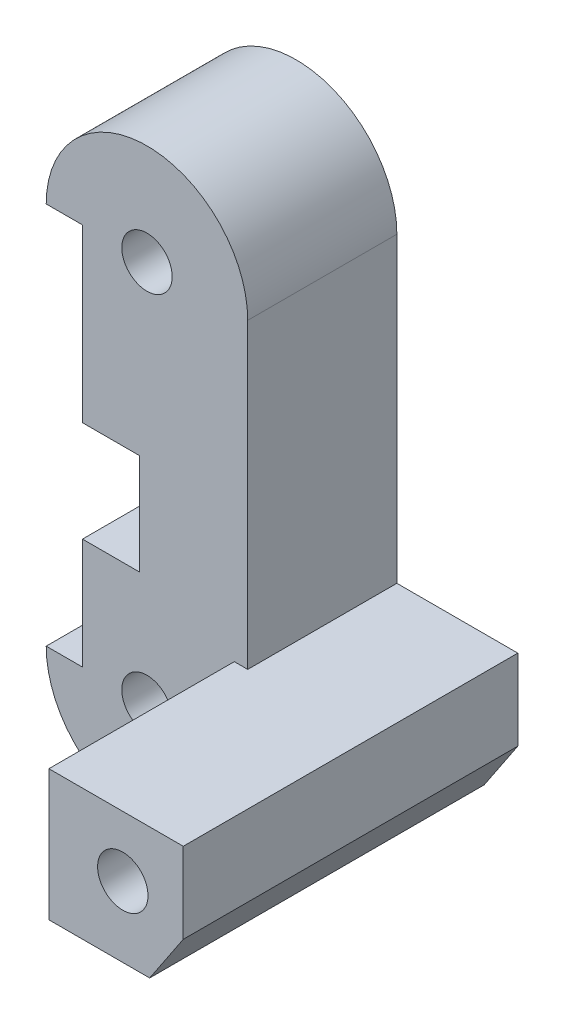
ISO-10303-21;
HEADER;
FILE_DESCRIPTION(('STEP AP214'),'2;1');
FILE_NAME('part.step','',(''),(''),'','','');
FILE_SCHEMA(('AUTOMOTIVE_DESIGN { 1 0 10303 214 1 1 1 1 }'));
ENDSEC;
DATA;
#1=APPLICATION_CONTEXT('core data for automotive mechanical design processes');
#2=APPLICATION_PROTOCOL_DEFINITION('international standard','automotive_design',2000,#1);
#3=PRODUCT_CONTEXT('',#1,'mechanical');
#4=PRODUCT('Part','Part','',(#3));
#5=PRODUCT_RELATED_PRODUCT_CATEGORY('part','',(#4));
#6=PRODUCT_DEFINITION_FORMATION('','',#4);
#7=PRODUCT_DEFINITION_CONTEXT('part definition',#1,'design');
#8=PRODUCT_DEFINITION('design','',#6,#7);
#9=PRODUCT_DEFINITION_SHAPE('','',#8);
#10=(LENGTH_UNIT() NAMED_UNIT(*) SI_UNIT(.MILLI.,.METRE.));
#11=(NAMED_UNIT(*) PLANE_ANGLE_UNIT() SI_UNIT($,.RADIAN.));
#12=(NAMED_UNIT(*) SI_UNIT($,.STERADIAN.) SOLID_ANGLE_UNIT());
#13=UNCERTAINTY_MEASURE_WITH_UNIT(LENGTH_MEASURE(1.E-05),#10,'distance_accuracy_value','');
#14=(GEOMETRIC_REPRESENTATION_CONTEXT(3) GLOBAL_UNCERTAINTY_ASSIGNED_CONTEXT((#13)) GLOBAL_UNIT_ASSIGNED_CONTEXT((#10,
#11,#12)) REPRESENTATION_CONTEXT('',''));
#15=CARTESIAN_POINT('',(0.,0.,0.));
#16=DIRECTION('',(0.,0.,1.));
#17=DIRECTION('',(1.,0.,0.));
#18=AXIS2_PLACEMENT_3D('',#15,#16,#17);
#19=CARTESIAN_POINT('',(-3.2,19.,7.4));
#20=DIRECTION('',(0.,1.,0.));
#21=DIRECTION('',(0.,0.,1.));
#22=AXIS2_PLACEMENT_3D('',#19,#20,#21);
#23=PLANE('',#22);
#24=DIRECTION('',(1.,0.,0.));
#25=VECTOR('',#24,1.);
#26=CARTESIAN_POINT('',(-3.2,19.,0.));
#27=LINE('',#26,#25);
#28=CARTESIAN_POINT('',(-5.,19.,0.));
#29=VERTEX_POINT('',#28);
#30=CARTESIAN_POINT('',(-3.2,19.,0.));
#31=VERTEX_POINT('',#30);
#32=EDGE_CURVE('E195',#29,#31,#27,.T.);
#33=ORIENTED_EDGE('',*,*,#32,.T.);
#34=DIRECTION('',(0.,0.,-1.));
#35=VECTOR('',#34,1.);
#36=CARTESIAN_POINT('',(-3.2,19.,7.4));
#37=LINE('',#36,#35);
#38=CARTESIAN_POINT('',(-3.2,19.,7.4));
#39=VERTEX_POINT('',#38);
#40=EDGE_CURVE('E239',#39,#31,#37,.T.);
#41=ORIENTED_EDGE('',*,*,#40,.F.);
#42=DIRECTION('',(1.,0.,0.));
#43=VECTOR('',#42,1.);
#44=CARTESIAN_POINT('',(-3.2,19.,7.4));
#45=LINE('',#44,#43);
#46=CARTESIAN_POINT('',(-5.,19.,7.4));
#47=VERTEX_POINT('',#46);
#48=EDGE_CURVE('E179',#47,#39,#45,.T.);
#49=ORIENTED_EDGE('',*,*,#48,.F.);
#50=DIRECTION('',(0.,0.,-1.));
#51=VECTOR('',#50,1.);
#52=CARTESIAN_POINT('',(-5.,19.,7.4));
#53=LINE('',#52,#51);
#54=EDGE_CURVE('E194',#47,#29,#53,.T.);
#55=ORIENTED_EDGE('',*,*,#54,.T.);
#56=EDGE_LOOP('',(#33,#41,#49,#55));
#57=FACE_BOUND('',#56,.T.);
#58=ADVANCED_FACE('F39',(#57),#23,.F.);
#59=CARTESIAN_POINT('',(-3.2,19.,7.4));
#60=DIRECTION('',(1.,0.,0.));
#61=DIRECTION('',(0.,1.,0.));
#62=AXIS2_PLACEMENT_3D('',#59,#60,#61);
#63=PLANE('',#62);
#64=CARTESIAN_POINT('',(-3.2,14.,4.4));
#65=DIRECTION('',(-1.,0.,0.));
#66=DIRECTION('',(0.,0.,1.));
#67=AXIS2_PLACEMENT_3D('',#64,#65,#66);
#68=CIRCLE('',#67,1.24999999999999);
#69=CARTESIAN_POINT('',(-3.2,14.,5.64999999999999));
#70=VERTEX_POINT('',#69);
#71=EDGE_CURVE('E315',#70,#70,#68,.T.);
#72=ORIENTED_EDGE('',*,*,#71,.F.);
#73=EDGE_LOOP('',(#72));
#74=FACE_BOUND('',#73,.T.);
#75=CARTESIAN_POINT('',(-3.2,4.,4.4));
#76=DIRECTION('',(-1.,0.,0.));
#77=DIRECTION('',(0.,0.,1.));
#78=AXIS2_PLACEMENT_3D('',#75,#76,#77);
#79=CIRCLE('',#78,1.24999999999999);
#80=CARTESIAN_POINT('',(-3.2,4.,5.64999999999999));
#81=VERTEX_POINT('',#80);
#82=EDGE_CURVE('E301',#81,#81,#79,.T.);
#83=ORIENTED_EDGE('',*,*,#82,.F.);
#84=EDGE_LOOP('',(#83));
#85=FACE_BOUND('',#84,.T.);
#86=DIRECTION('',(0.,-1.,0.));
#87=VECTOR('',#86,1.);
#88=CARTESIAN_POINT('',(-3.2,10.5,4.57157287525381));
#89=LINE('',#88,#87);
#90=CARTESIAN_POINT('',(-3.2,10.5,4.57157287525381));
#91=VERTEX_POINT('',#90);
#92=CARTESIAN_POINT('',(-3.2,5.5,4.57157287525381));
#93=VERTEX_POINT('',#92);
#94=EDGE_CURVE('E173',#91,#93,#89,.T.);
#95=ORIENTED_EDGE('',*,*,#94,.F.);
#96=DIRECTION('',(0.,0.,1.));
#97=VECTOR('',#96,1.);
#98=CARTESIAN_POINT('',(-3.2,10.5,4.57157287525381));
#99=LINE('',#98,#97);
#100=CARTESIAN_POINT('',(-3.2,10.5,7.4));
#101=VERTEX_POINT('',#100);
#102=EDGE_CURVE('E161',#91,#101,#99,.T.);
#103=ORIENTED_EDGE('',*,*,#102,.T.);
#104=DIRECTION('',(0.,-1.,0.));
#105=VECTOR('',#104,1.);
#106=CARTESIAN_POINT('',(-3.2,19.,7.4));
#107=LINE('',#106,#105);
#108=EDGE_CURVE('E170',#39,#101,#107,.T.);
#109=ORIENTED_EDGE('',*,*,#108,.F.);
#110=ORIENTED_EDGE('',*,*,#40,.T.);
#111=DIRECTION('',(0.,-1.,0.));
#112=VECTOR('',#111,1.);
#113=CARTESIAN_POINT('',(-3.2,19.,0.));
#114=LINE('',#113,#112);
#115=CARTESIAN_POINT('',(-3.2,0.,0.));
#116=VERTEX_POINT('',#115);
#117=EDGE_CURVE('E198',#31,#116,#114,.T.);
#118=ORIENTED_EDGE('',*,*,#117,.T.);
#119=DIRECTION('',(0.,0.,-1.));
#120=VECTOR('',#119,1.);
#121=CARTESIAN_POINT('',(-3.2,0.,7.4));
#122=LINE('',#121,#120);
#123=CARTESIAN_POINT('',(-3.2,0.,7.4));
#124=VERTEX_POINT('',#123);
#125=EDGE_CURVE('E236',#124,#116,#122,.T.);
#126=ORIENTED_EDGE('',*,*,#125,.F.);
#127=CARTESIAN_POINT('',(-3.2,5.5,7.4));
#128=VERTEX_POINT('',#127);
#129=EDGE_CURVE('E182',#128,#124,#107,.T.);
#130=ORIENTED_EDGE('',*,*,#129,.F.);
#131=DIRECTION('',(0.,0.,1.));
#132=VECTOR('',#131,1.);
#133=CARTESIAN_POINT('',(-3.2,5.5,4.57157287525381));
#134=LINE('',#133,#132);
#135=EDGE_CURVE('E54',#93,#128,#134,.T.);
#136=ORIENTED_EDGE('',*,*,#135,.F.);
#137=EDGE_LOOP('',(#95,#103,#109,#110,#118,#126,#130,#136));
#138=FACE_BOUND('',#137,.T.);
#139=ADVANCED_FACE('F168',(#74,#85,#138),#63,.F.);
#140=CARTESIAN_POINT('',(-3.2,0.,7.4));
#141=DIRECTION('',(0.,-1.,0.));
#142=DIRECTION('',(1.,0.,0.));
#143=AXIS2_PLACEMENT_3D('',#140,#141,#142);
#144=PLANE('',#143);
#145=DIRECTION('',(-1.,0.,0.));
#146=VECTOR('',#145,1.);
#147=CARTESIAN_POINT('',(-3.2,0.,0.));
#148=LINE('',#147,#146);
#149=CARTESIAN_POINT('',(-5.,0.,0.));
#150=VERTEX_POINT('',#149);
#151=EDGE_CURVE('E201',#116,#150,#148,.T.);
#152=ORIENTED_EDGE('',*,*,#151,.T.);
#153=DIRECTION('',(0.,0.,-1.));
#154=VECTOR('',#153,1.);
#155=CARTESIAN_POINT('',(-5.,0.,7.4));
#156=LINE('',#155,#154);
#157=CARTESIAN_POINT('',(-5.,0.,7.4));
#158=VERTEX_POINT('',#157);
#159=EDGE_CURVE('E233',#158,#150,#156,.T.);
#160=ORIENTED_EDGE('',*,*,#159,.F.);
#161=DIRECTION('',(-1.,0.,0.));
#162=VECTOR('',#161,1.);
#163=CARTESIAN_POINT('',(-3.2,0.,7.4));
#164=LINE('',#163,#162);
#165=EDGE_CURVE('E181',#124,#158,#164,.T.);
#166=ORIENTED_EDGE('',*,*,#165,.F.);
#167=ORIENTED_EDGE('',*,*,#125,.T.);
#168=EDGE_LOOP('',(#152,#160,#166,#167));
#169=FACE_BOUND('',#168,.T.);
#170=ADVANCED_FACE('F345',(#169),#144,.F.);
#171=CARTESIAN_POINT('',(0.,0.,7.4));
#172=DIRECTION('',(0.,0.,-1.));
#173=DIRECTION('',(-1.,0.,0.));
#174=AXIS2_PLACEMENT_3D('',#171,#172,#173);
#175=CYLINDRICAL_SURFACE('',#174,5.);
#176=CARTESIAN_POINT('',(0.,0.,0.));
#177=DIRECTION('',(0.,0.,1.));
#178=DIRECTION('',(1.,0.,0.));
#179=AXIS2_PLACEMENT_3D('',#176,#177,#178);
#180=CIRCLE('',#179,5.);
#181=CARTESIAN_POINT('',(3.83326103686206,-3.21031304132092,0.));
#182=VERTEX_POINT('',#181);
#183=EDGE_CURVE('E203',#150,#182,#180,.T.);
#184=ORIENTED_EDGE('',*,*,#183,.T.);
#185=DIRECTION('',(0.,0.,-1.));
#186=VECTOR('',#185,1.);
#187=CARTESIAN_POINT('',(3.83326103686206,-3.21031304132092,7.4));
#188=LINE('',#187,#186);
#189=CARTESIAN_POINT('',(3.83326103686206,-3.21031304132092,7.4));
#190=VERTEX_POINT('',#189);
#191=EDGE_CURVE('E262',#182,#190,#188,.F.);
#192=ORIENTED_EDGE('',*,*,#191,.T.);
#193=CARTESIAN_POINT('',(0.,0.,7.4));
#194=DIRECTION('',(0.,0.,1.));
#195=DIRECTION('',(1.,0.,0.));
#196=AXIS2_PLACEMENT_3D('',#193,#194,#195);
#197=CIRCLE('',#196,5.);
#198=EDGE_CURVE('E184',#158,#190,#197,.T.);
#199=ORIENTED_EDGE('',*,*,#198,.F.);
#200=ORIENTED_EDGE('',*,*,#159,.T.);
#201=EDGE_LOOP('',(#184,#192,#199,#200));
#202=FACE_BOUND('',#201,.T.);
#203=ADVANCED_FACE('F274',(#202),#175,.T.);
#204=CARTESIAN_POINT('',(4.33333333333333,-2.49443825784929,7.4));
#205=DIRECTION('',(0.,1.,0.));
#206=DIRECTION('',(0.,0.,1.));
#207=AXIS2_PLACEMENT_3D('',#204,#205,#206);
#208=PLANE('',#207);
#209=DIRECTION('',(1.,0.,0.));
#210=VECTOR('',#209,1.);
#211=CARTESIAN_POINT('',(4.33333333333333,-2.49443825784929,7.4));
#212=LINE('',#211,#210);
#213=CARTESIAN_POINT('',(4.33333333333333,-2.4944382578493,7.4));
#214=VERTEX_POINT('',#213);
#215=CARTESIAN_POINT('',(5.36656545160689,-2.49443825784929,7.4));
#216=VERTEX_POINT('',#215);
#217=EDGE_CURVE('E61',#214,#216,#212,.T.);
#218=ORIENTED_EDGE('',*,*,#217,.T.);
#219=DIRECTION('',(0.,0.,1.));
#220=VECTOR('',#219,1.);
#221=CARTESIAN_POINT('',(5.36656545160689,-2.49443825784929,0.));
#222=LINE('',#221,#220);
#223=CARTESIAN_POINT('',(5.36656545160689,-2.49443825784929,0.));
#224=VERTEX_POINT('',#223);
#225=EDGE_CURVE('E259',#216,#224,#222,.F.);
#226=ORIENTED_EDGE('',*,*,#225,.T.);
#227=DIRECTION('',(1.,0.,0.));
#228=VECTOR('',#227,1.);
#229=CARTESIAN_POINT('',(4.33333333333333,-2.49443825784929,0.));
#230=LINE('',#229,#228);
#231=CARTESIAN_POINT('',(9.33333333333333,-2.49443825784929,0.));
#232=VERTEX_POINT('',#231);
#233=EDGE_CURVE('E206',#224,#232,#230,.T.);
#234=ORIENTED_EDGE('',*,*,#233,.T.);
#235=DIRECTION('',(0.,0.,-1.));
#236=VECTOR('',#235,1.);
#237=CARTESIAN_POINT('',(9.33333333333333,-2.49443825784929,7.4));
#238=LINE('',#237,#236);
#239=CARTESIAN_POINT('',(9.33333333333333,-2.49443825784929,16.6));
#240=VERTEX_POINT('',#239);
#241=EDGE_CURVE('E230',#240,#232,#238,.T.);
#242=ORIENTED_EDGE('',*,*,#241,.F.);
#243=DIRECTION('',(1.,0.,0.));
#244=VECTOR('',#243,1.);
#245=CARTESIAN_POINT('',(4.33333333333333,-2.4944382578493,16.6));
#246=LINE('',#245,#244);
#247=CARTESIAN_POINT('',(4.33333333333333,-2.4944382578493,16.6));
#248=VERTEX_POINT('',#247);
#249=EDGE_CURVE('E285',#248,#240,#246,.T.);
#250=ORIENTED_EDGE('',*,*,#249,.F.);
#251=DIRECTION('',(0.,0.,-1.));
#252=VECTOR('',#251,1.);
#253=CARTESIAN_POINT('',(4.33333333333333,-2.4944382578493,16.6));
#254=LINE('',#253,#252);
#255=EDGE_CURVE('E282',#248,#214,#254,.T.);
#256=ORIENTED_EDGE('',*,*,#255,.T.);
#257=EDGE_LOOP('',(#218,#226,#234,#242,#250,#256));
#258=FACE_BOUND('',#257,.T.);
#259=ADVANCED_FACE('F279',(#258),#208,.F.);
#260=CARTESIAN_POINT('',(9.33333333333333,-2.49443825784929,7.4));
#261=DIRECTION('',(-0.831479419283099,0.555555555555555,0.));
#262=DIRECTION('',(-0.555555555555555,-0.831479419283099,0.));
#263=AXIS2_PLACEMENT_3D('',#260,#261,#262);
#264=PLANE('',#263);
#265=DIRECTION('',(0.555555555555555,0.831479419283099,0.));
#266=VECTOR('',#265,1.);
#267=CARTESIAN_POINT('',(9.33333333333333,-2.49443825784929,0.));
#268=LINE('',#267,#266);
#269=CARTESIAN_POINT('',(11.,0.,0.));
#270=VERTEX_POINT('',#269);
#271=EDGE_CURVE('E208',#232,#270,#268,.T.);
#272=ORIENTED_EDGE('',*,*,#271,.T.);
#273=DIRECTION('',(0.,0.,-1.));
#274=VECTOR('',#273,1.);
#275=CARTESIAN_POINT('',(11.,0.,7.4));
#276=LINE('',#275,#274);
#277=CARTESIAN_POINT('',(11.,0.,16.6));
#278=VERTEX_POINT('',#277);
#279=EDGE_CURVE('E227',#278,#270,#276,.T.);
#280=ORIENTED_EDGE('',*,*,#279,.F.);
#281=DIRECTION('',(0.555555555555555,0.831479419283099,0.));
#282=VECTOR('',#281,1.);
#283=CARTESIAN_POINT('',(9.33333333333333,-2.49443825784929,16.6));
#284=LINE('',#283,#282);
#285=EDGE_CURVE('E288',#240,#278,#284,.T.);
#286=ORIENTED_EDGE('',*,*,#285,.F.);
#287=ORIENTED_EDGE('',*,*,#241,.T.);
#288=EDGE_LOOP('',(#272,#280,#286,#287));
#289=FACE_BOUND('',#288,.T.);
#290=ADVANCED_FACE('F367',(#289),#264,.F.);
#291=CARTESIAN_POINT('',(11.,0.,7.4));
#292=DIRECTION('',(-1.,0.,0.));
#293=DIRECTION('',(0.,-1.,0.));
#294=AXIS2_PLACEMENT_3D('',#291,#292,#293);
#295=PLANE('',#294);
#296=DIRECTION('',(0.,1.,0.));
#297=VECTOR('',#296,1.);
#298=CARTESIAN_POINT('',(11.,0.,0.));
#299=LINE('',#298,#297);
#300=CARTESIAN_POINT('',(11.,4.,0.));
#301=VERTEX_POINT('',#300);
#302=EDGE_CURVE('E210',#270,#301,#299,.T.);
#303=ORIENTED_EDGE('',*,*,#302,.T.);
#304=DIRECTION('',(0.,0.,-1.));
#305=VECTOR('',#304,1.);
#306=CARTESIAN_POINT('',(11.,4.,7.4));
#307=LINE('',#306,#305);
#308=CARTESIAN_POINT('',(11.,4.,16.6));
#309=VERTEX_POINT('',#308);
#310=EDGE_CURVE('E224',#309,#301,#307,.T.);
#311=ORIENTED_EDGE('',*,*,#310,.F.);
#312=DIRECTION('',(0.,1.,0.));
#313=VECTOR('',#312,1.);
#314=CARTESIAN_POINT('',(11.,0.,16.6));
#315=LINE('',#314,#313);
#316=EDGE_CURVE('E294',#278,#309,#315,.T.);
#317=ORIENTED_EDGE('',*,*,#316,.F.);
#318=ORIENTED_EDGE('',*,*,#279,.T.);
#319=EDGE_LOOP('',(#303,#311,#317,#318));
#320=FACE_BOUND('',#319,.T.);
#321=ADVANCED_FACE('F365',(#320),#295,.F.);
#322=CARTESIAN_POINT('',(11.,4.,7.4));
#323=DIRECTION('',(0.,-1.,0.));
#324=DIRECTION('',(1.,0.,0.));
#325=AXIS2_PLACEMENT_3D('',#322,#323,#324);
#326=PLANE('',#325);
#327=DIRECTION('',(-1.,0.,0.));
#328=VECTOR('',#327,1.);
#329=CARTESIAN_POINT('',(11.,4.,0.));
#330=LINE('',#329,#328);
#331=CARTESIAN_POINT('',(5.,4.,0.));
#332=VERTEX_POINT('',#331);
#333=EDGE_CURVE('E212',#301,#332,#330,.T.);
#334=ORIENTED_EDGE('',*,*,#333,.T.);
#335=DIRECTION('',(0.,0.,-1.));
#336=VECTOR('',#335,1.);
#337=CARTESIAN_POINT('',(5.,4.,7.4));
#338=LINE('',#337,#336);
#339=CARTESIAN_POINT('',(5.,4.,7.4));
#340=VERTEX_POINT('',#339);
#341=EDGE_CURVE('E223',#340,#332,#338,.T.);
#342=ORIENTED_EDGE('',*,*,#341,.F.);
#343=DIRECTION('',(-1.,0.,0.));
#344=VECTOR('',#343,1.);
#345=CARTESIAN_POINT('',(5.,4.,7.4));
#346=LINE('',#345,#344);
#347=CARTESIAN_POINT('',(4.33333333333333,4.,7.4));
#348=VERTEX_POINT('',#347);
#349=EDGE_CURVE('E241',#340,#348,#346,.T.);
#350=ORIENTED_EDGE('',*,*,#349,.T.);
#351=DIRECTION('',(0.,0.,-1.));
#352=VECTOR('',#351,1.);
#353=CARTESIAN_POINT('',(4.33333333333333,4.,16.6));
#354=LINE('',#353,#352);
#355=CARTESIAN_POINT('',(4.33333333333333,4.,16.6));
#356=VERTEX_POINT('',#355);
#357=EDGE_CURVE('E199',#356,#348,#354,.T.);
#358=ORIENTED_EDGE('',*,*,#357,.F.);
#359=DIRECTION('',(-1.,0.,0.));
#360=VECTOR('',#359,1.);
#361=CARTESIAN_POINT('',(11.,4.,16.6));
#362=LINE('',#361,#360);
#363=EDGE_CURVE('E298',#309,#356,#362,.T.);
#364=ORIENTED_EDGE('',*,*,#363,.F.);
#365=ORIENTED_EDGE('',*,*,#310,.T.);
#366=EDGE_LOOP('',(#334,#342,#350,#358,#364,#365));
#367=FACE_BOUND('',#366,.T.);
#368=ADVANCED_FACE('F361',(#367),#326,.F.);
#369=CARTESIAN_POINT('',(5.,4.,7.4));
#370=DIRECTION('',(-1.,0.,0.));
#371=DIRECTION('',(0.,-1.,0.));
#372=AXIS2_PLACEMENT_3D('',#369,#370,#371);
#373=PLANE('',#372);
#374=DIRECTION('',(0.,1.,0.));
#375=VECTOR('',#374,1.);
#376=CARTESIAN_POINT('',(5.,4.,0.));
#377=LINE('',#376,#375);
#378=CARTESIAN_POINT('',(5.,19.,0.));
#379=VERTEX_POINT('',#378);
#380=EDGE_CURVE('E214',#332,#379,#377,.T.);
#381=ORIENTED_EDGE('',*,*,#380,.T.);
#382=DIRECTION('',(0.,0.,-1.));
#383=VECTOR('',#382,1.);
#384=CARTESIAN_POINT('',(5.,19.,7.4));
#385=LINE('',#384,#383);
#386=CARTESIAN_POINT('',(5.,19.,7.4));
#387=VERTEX_POINT('',#386);
#388=EDGE_CURVE('E220',#387,#379,#385,.T.);
#389=ORIENTED_EDGE('',*,*,#388,.F.);
#390=DIRECTION('',(0.,1.,0.));
#391=VECTOR('',#390,1.);
#392=CARTESIAN_POINT('',(5.,4.,7.4));
#393=LINE('',#392,#391);
#394=EDGE_CURVE('E191',#340,#387,#393,.T.);
#395=ORIENTED_EDGE('',*,*,#394,.F.);
#396=ORIENTED_EDGE('',*,*,#341,.T.);
#397=EDGE_LOOP('',(#381,#389,#395,#396));
#398=FACE_BOUND('',#397,.T.);
#399=ADVANCED_FACE('F357',(#398),#373,.F.);
#400=CARTESIAN_POINT('',(0.,19.,7.4));
#401=DIRECTION('',(0.,0.,-1.));
#402=DIRECTION('',(-1.,0.,0.));
#403=AXIS2_PLACEMENT_3D('',#400,#401,#402);
#404=CYLINDRICAL_SURFACE('',#403,5.);
#405=CARTESIAN_POINT('',(0.,19.,0.));
#406=DIRECTION('',(0.,0.,1.));
#407=DIRECTION('',(1.,0.,0.));
#408=AXIS2_PLACEMENT_3D('',#405,#406,#407);
#409=CIRCLE('',#408,5.);
#410=EDGE_CURVE('E216',#379,#29,#409,.T.);
#411=ORIENTED_EDGE('',*,*,#410,.T.);
#412=ORIENTED_EDGE('',*,*,#54,.F.);
#413=CARTESIAN_POINT('',(0.,19.,7.4));
#414=DIRECTION('',(0.,0.,1.));
#415=DIRECTION('',(1.,0.,0.));
#416=AXIS2_PLACEMENT_3D('',#413,#414,#415);
#417=CIRCLE('',#416,5.);
#418=EDGE_CURVE('E192',#387,#47,#417,.T.);
#419=ORIENTED_EDGE('',*,*,#418,.F.);
#420=ORIENTED_EDGE('',*,*,#388,.T.);
#421=EDGE_LOOP('',(#411,#412,#419,#420));
#422=FACE_BOUND('',#421,.T.);
#423=ADVANCED_FACE('F351',(#422),#404,.T.);
#424=CARTESIAN_POINT('',(0.,19.,7.4));
#425=DIRECTION('',(0.,0.,1.));
#426=DIRECTION('',(1.,0.,0.));
#427=AXIS2_PLACEMENT_3D('',#424,#425,#426);
#428=PLANE('',#427);
#429=DIRECTION('',(1.,0.,0.));
#430=VECTOR('',#429,1.);
#431=CARTESIAN_POINT('',(-3.2,10.5,7.4));
#432=LINE('',#431,#430);
#433=CARTESIAN_POINT('',(-0.37157287525381,10.5,7.4));
#434=VERTEX_POINT('',#433);
#435=EDGE_CURVE('E158',#101,#434,#432,.T.);
#436=ORIENTED_EDGE('',*,*,#435,.T.);
#437=DIRECTION('',(0.,-1.,0.));
#438=VECTOR('',#437,1.);
#439=CARTESIAN_POINT('',(-0.37157287525381,10.5,7.4));
#440=LINE('',#439,#438);
#441=CARTESIAN_POINT('',(-0.37157287525381,5.5,7.4));
#442=VERTEX_POINT('',#441);
#443=EDGE_CURVE('E331',#434,#442,#440,.T.);
#444=ORIENTED_EDGE('',*,*,#443,.T.);
#445=DIRECTION('',(1.,0.,0.));
#446=VECTOR('',#445,1.);
#447=CARTESIAN_POINT('',(-3.2,5.5,7.4));
#448=LINE('',#447,#446);
#449=EDGE_CURVE('E335',#128,#442,#448,.T.);
#450=ORIENTED_EDGE('',*,*,#449,.F.);
#451=ORIENTED_EDGE('',*,*,#129,.T.);
#452=ORIENTED_EDGE('',*,*,#165,.T.);
#453=ORIENTED_EDGE('',*,*,#198,.T.);
#454=CARTESIAN_POINT('',(5.36656545160689,-4.49443825784929,7.4));
#455=DIRECTION('',(0.,0.,1.));
#456=DIRECTION('',(1.,0.,0.));
#457=AXIS2_PLACEMENT_3D('',#454,#455,#456);
#458=CIRCLE('',#457,2.);
#459=EDGE_CURVE('E11',#190,#216,#458,.F.);
#460=ORIENTED_EDGE('',*,*,#459,.T.);
#461=ORIENTED_EDGE('',*,*,#217,.F.);
#462=DIRECTION('',(0.,-1.,0.));
#463=VECTOR('',#462,1.);
#464=CARTESIAN_POINT('',(4.33333333333333,-2.4944382578493,7.4));
#465=LINE('',#464,#463);
#466=EDGE_CURVE('E291',#348,#214,#465,.T.);
#467=ORIENTED_EDGE('',*,*,#466,.F.);
#468=ORIENTED_EDGE('',*,*,#349,.F.);
#469=ORIENTED_EDGE('',*,*,#394,.T.);
#470=ORIENTED_EDGE('',*,*,#418,.T.);
#471=ORIENTED_EDGE('',*,*,#48,.T.);
#472=ORIENTED_EDGE('',*,*,#108,.T.);
#473=EDGE_LOOP('',(#436,#444,#450,#451,#452,#453,#460,#461,#467,#468,#469,#470,#471,#472));
#474=FACE_BOUND('',#473,.T.);
#475=CARTESIAN_POINT('',(0.,0.,7.4));
#476=DIRECTION('',(0.,0.,1.));
#477=DIRECTION('',(1.,0.,0.));
#478=AXIS2_PLACEMENT_3D('',#475,#476,#477);
#479=CIRCLE('',#478,1.24999999999999);
#480=CARTESIAN_POINT('',(1.24999999999999,0.,7.4));
#481=VERTEX_POINT('',#480);
#482=EDGE_CURVE('E256',#481,#481,#479,.T.);
#483=ORIENTED_EDGE('',*,*,#482,.F.);
#484=EDGE_LOOP('',(#483));
#485=FACE_BOUND('',#484,.T.);
#486=CARTESIAN_POINT('',(0.,19.,7.4));
#487=DIRECTION('',(0.,0.,1.));
#488=DIRECTION('',(1.,0.,0.));
#489=AXIS2_PLACEMENT_3D('',#486,#487,#488);
#490=CIRCLE('',#489,1.24999999999999);
#491=CARTESIAN_POINT('',(1.24999999999999,19.,7.4));
#492=VERTEX_POINT('',#491);
#493=EDGE_CURVE('E321',#492,#492,#490,.T.);
#494=ORIENTED_EDGE('',*,*,#493,.F.);
#495=EDGE_LOOP('',(#494));
#496=FACE_BOUND('',#495,.T.);
#497=ADVANCED_FACE('F176',(#474,#485,#496),#428,.T.);
#498=CARTESIAN_POINT('',(0.,19.,0.));
#499=DIRECTION('',(0.,0.,1.));
#500=DIRECTION('',(1.,0.,0.));
#501=AXIS2_PLACEMENT_3D('',#498,#499,#500);
#502=PLANE('',#501);
#503=CARTESIAN_POINT('',(8.,1.,0.));
#504=DIRECTION('',(0.,0.,1.));
#505=DIRECTION('',(1.,0.,0.));
#506=AXIS2_PLACEMENT_3D('',#503,#504,#505);
#507=CIRCLE('',#506,1.24999999999999);
#508=CARTESIAN_POINT('',(9.24999999999999,1.,0.));
#509=VERTEX_POINT('',#508);
#510=EDGE_CURVE('E253',#509,#509,#507,.T.);
#511=ORIENTED_EDGE('',*,*,#510,.T.);
#512=EDGE_LOOP('',(#511));
#513=FACE_BOUND('',#512,.T.);
#514=CARTESIAN_POINT('',(0.,0.,0.));
#515=DIRECTION('',(0.,0.,1.));
#516=DIRECTION('',(1.,0.,0.));
#517=AXIS2_PLACEMENT_3D('',#514,#515,#516);
#518=CIRCLE('',#517,1.24999999999999);
#519=CARTESIAN_POINT('',(1.24999999999999,0.,0.));
#520=VERTEX_POINT('',#519);
#521=EDGE_CURVE('E324',#520,#520,#518,.T.);
#522=ORIENTED_EDGE('',*,*,#521,.T.);
#523=EDGE_LOOP('',(#522));
#524=FACE_BOUND('',#523,.T.);
#525=CARTESIAN_POINT('',(0.,19.,0.));
#526=DIRECTION('',(0.,0.,1.));
#527=DIRECTION('',(1.,0.,0.));
#528=AXIS2_PLACEMENT_3D('',#525,#526,#527);
#529=CIRCLE('',#528,1.24999999999999);
#530=CARTESIAN_POINT('',(1.24999999999999,19.,0.));
#531=VERTEX_POINT('',#530);
#532=EDGE_CURVE('E318',#531,#531,#529,.T.);
#533=ORIENTED_EDGE('',*,*,#532,.T.);
#534=EDGE_LOOP('',(#533));
#535=FACE_BOUND('',#534,.T.);
#536=ORIENTED_EDGE('',*,*,#32,.F.);
#537=ORIENTED_EDGE('',*,*,#410,.F.);
#538=ORIENTED_EDGE('',*,*,#380,.F.);
#539=ORIENTED_EDGE('',*,*,#333,.F.);
#540=ORIENTED_EDGE('',*,*,#302,.F.);
#541=ORIENTED_EDGE('',*,*,#271,.F.);
#542=ORIENTED_EDGE('',*,*,#233,.F.);
#543=CARTESIAN_POINT('',(5.36656545160689,-4.49443825784929,0.));
#544=DIRECTION('',(0.,0.,1.));
#545=DIRECTION('',(1.,0.,0.));
#546=AXIS2_PLACEMENT_3D('',#543,#544,#545);
#547=CIRCLE('',#546,2.);
#548=EDGE_CURVE('E47',#224,#182,#547,.T.);
#549=ORIENTED_EDGE('',*,*,#548,.T.);
#550=ORIENTED_EDGE('',*,*,#183,.F.);
#551=ORIENTED_EDGE('',*,*,#151,.F.);
#552=ORIENTED_EDGE('',*,*,#117,.F.);
#553=EDGE_LOOP('',(#536,#537,#538,#539,#540,#541,#542,#549,#550,#551,#552));
#554=FACE_BOUND('',#553,.T.);
#555=ADVANCED_FACE('F267',(#513,#524,#535,#554),#502,.F.);
#556=CARTESIAN_POINT('',(4.33333333333333,-2.4944382578493,16.6));
#557=DIRECTION('',(1.,0.,0.));
#558=DIRECTION('',(0.,0.,-1.));
#559=AXIS2_PLACEMENT_3D('',#556,#557,#558);
#560=PLANE('',#559);
#561=ORIENTED_EDGE('',*,*,#466,.T.);
#562=ORIENTED_EDGE('',*,*,#255,.F.);
#563=DIRECTION('',(0.,-1.,0.));
#564=VECTOR('',#563,1.);
#565=CARTESIAN_POINT('',(4.33333333333333,-2.4944382578493,16.6));
#566=LINE('',#565,#564);
#567=EDGE_CURVE('E307',#356,#248,#566,.T.);
#568=ORIENTED_EDGE('',*,*,#567,.F.);
#569=ORIENTED_EDGE('',*,*,#357,.T.);
#570=EDGE_LOOP('',(#561,#562,#568,#569));
#571=FACE_BOUND('',#570,.T.);
#572=ADVANCED_FACE('F292',(#571),#560,.F.);
#573=CARTESIAN_POINT('',(0.,0.,16.6));
#574=DIRECTION('',(0.,0.,1.));
#575=DIRECTION('',(1.,0.,0.));
#576=AXIS2_PLACEMENT_3D('',#573,#574,#575);
#577=PLANE('',#576);
#578=CARTESIAN_POINT('',(8.,1.,16.6));
#579=DIRECTION('',(0.,0.,1.));
#580=DIRECTION('',(1.,0.,0.));
#581=AXIS2_PLACEMENT_3D('',#578,#579,#580);
#582=CIRCLE('',#581,1.24999999999999);
#583=CARTESIAN_POINT('',(9.24999999999999,1.,16.6));
#584=VERTEX_POINT('',#583);
#585=EDGE_CURVE('E257',#584,#584,#582,.T.);
#586=ORIENTED_EDGE('',*,*,#585,.F.);
#587=EDGE_LOOP('',(#586));
#588=FACE_BOUND('',#587,.T.);
#589=ORIENTED_EDGE('',*,*,#316,.T.);
#590=ORIENTED_EDGE('',*,*,#363,.T.);
#591=ORIENTED_EDGE('',*,*,#567,.T.);
#592=ORIENTED_EDGE('',*,*,#249,.T.);
#593=ORIENTED_EDGE('',*,*,#285,.T.);
#594=EDGE_LOOP('',(#589,#590,#591,#592,#593));
#595=FACE_BOUND('',#594,.T.);
#596=ADVANCED_FACE('F370',(#588,#595),#577,.T.);
#597=CARTESIAN_POINT('',(3.30000000000001,4.,4.4));
#598=DIRECTION('',(-1.,0.,0.));
#599=DIRECTION('',(0.,0.,1.));
#600=AXIS2_PLACEMENT_3D('',#597,#598,#599);
#601=CONICAL_SURFACE('',#600,1.24999999999999,1.02974425867665);
#602=CARTESIAN_POINT('',(4.05107577378445,4.,4.4));
#603=VERTEX_POINT('',#602);
#604=VERTEX_LOOP('',#603);
#605=FACE_BOUND('',#604,.T.);
#606=CARTESIAN_POINT('',(3.30000000000001,4.,4.4));
#607=DIRECTION('',(-1.,0.,0.));
#608=DIRECTION('',(0.,0.,1.));
#609=AXIS2_PLACEMENT_3D('',#606,#607,#608);
#610=CIRCLE('',#609,1.24999999999999);
#611=CARTESIAN_POINT('',(3.30000000000001,4.,5.64999999999999));
#612=VERTEX_POINT('',#611);
#613=EDGE_CURVE('E295',#612,#612,#610,.T.);
#614=ORIENTED_EDGE('',*,*,#613,.T.);
#615=EDGE_LOOP('',(#614));
#616=FACE_BOUND('',#615,.T.);
#617=ADVANCED_FACE('F372',(#605,#616),#601,.F.);
#618=CARTESIAN_POINT('',(-3.2,4.,4.4));
#619=DIRECTION('',(-1.,0.,0.));
#620=DIRECTION('',(0.,0.,1.));
#621=AXIS2_PLACEMENT_3D('',#618,#619,#620);
#622=CYLINDRICAL_SURFACE('',#621,1.24999999999999);
#623=ORIENTED_EDGE('',*,*,#613,.F.);
#624=EDGE_LOOP('',(#623));
#625=FACE_BOUND('',#624,.T.);
#626=ORIENTED_EDGE('',*,*,#82,.T.);
#627=EDGE_LOOP('',(#626));
#628=FACE_BOUND('',#627,.T.);
#629=ADVANCED_FACE('F379',(#625,#628),#622,.F.);
#630=CARTESIAN_POINT('',(3.3,14.,4.4));
#631=DIRECTION('',(-1.,0.,0.));
#632=DIRECTION('',(0.,0.,1.));
#633=AXIS2_PLACEMENT_3D('',#630,#631,#632);
#634=CONICAL_SURFACE('',#633,1.24999999999999,1.02974425867665);
#635=CARTESIAN_POINT('',(4.05107577378445,14.,4.4));
#636=VERTEX_POINT('',#635);
#637=VERTEX_LOOP('',#636);
#638=FACE_BOUND('',#637,.T.);
#639=CARTESIAN_POINT('',(3.3,14.,4.4));
#640=DIRECTION('',(-1.,0.,0.));
#641=DIRECTION('',(0.,0.,1.));
#642=AXIS2_PLACEMENT_3D('',#639,#640,#641);
#643=CIRCLE('',#642,1.24999999999999);
#644=CARTESIAN_POINT('',(3.3,14.,5.64999999999999));
#645=VERTEX_POINT('',#644);
#646=EDGE_CURVE('E312',#645,#645,#643,.T.);
#647=ORIENTED_EDGE('',*,*,#646,.T.);
#648=EDGE_LOOP('',(#647));
#649=FACE_BOUND('',#648,.T.);
#650=ADVANCED_FACE('F449',(#638,#649),#634,.F.);
#651=CARTESIAN_POINT('',(-3.2,14.,4.4));
#652=DIRECTION('',(-1.,0.,0.));
#653=DIRECTION('',(0.,0.,1.));
#654=AXIS2_PLACEMENT_3D('',#651,#652,#653);
#655=CYLINDRICAL_SURFACE('',#654,1.24999999999999);
#656=ORIENTED_EDGE('',*,*,#646,.F.);
#657=EDGE_LOOP('',(#656));
#658=FACE_BOUND('',#657,.T.);
#659=ORIENTED_EDGE('',*,*,#71,.T.);
#660=EDGE_LOOP('',(#659));
#661=FACE_BOUND('',#660,.T.);
#662=ADVANCED_FACE('F462',(#658,#661),#655,.F.);
#663=CARTESIAN_POINT('',(0.,19.,7.4));
#664=DIRECTION('',(0.,0.,1.));
#665=DIRECTION('',(1.,0.,0.));
#666=AXIS2_PLACEMENT_3D('',#663,#664,#665);
#667=CYLINDRICAL_SURFACE('',#666,1.24999999999999);
#668=ORIENTED_EDGE('',*,*,#493,.T.);
#669=EDGE_LOOP('',(#668));
#670=FACE_BOUND('',#669,.T.);
#671=ORIENTED_EDGE('',*,*,#532,.F.);
#672=EDGE_LOOP('',(#671));
#673=FACE_BOUND('',#672,.T.);
#674=ADVANCED_FACE('F472',(#670,#673),#667,.F.);
#675=CARTESIAN_POINT('',(0.,0.,7.4));
#676=DIRECTION('',(0.,0.,1.));
#677=DIRECTION('',(1.,0.,0.));
#678=AXIS2_PLACEMENT_3D('',#675,#676,#677);
#679=CYLINDRICAL_SURFACE('',#678,1.24999999999999);
#680=ORIENTED_EDGE('',*,*,#482,.T.);
#681=EDGE_LOOP('',(#680));
#682=FACE_BOUND('',#681,.T.);
#683=ORIENTED_EDGE('',*,*,#521,.F.);
#684=EDGE_LOOP('',(#683));
#685=FACE_BOUND('',#684,.T.);
#686=ADVANCED_FACE('F484',(#682,#685),#679,.F.);
#687=CARTESIAN_POINT('',(8.,1.,16.6));
#688=DIRECTION('',(0.,0.,1.));
#689=DIRECTION('',(1.,0.,0.));
#690=AXIS2_PLACEMENT_3D('',#687,#688,#689);
#691=CYLINDRICAL_SURFACE('',#690,1.24999999999999);
#692=ORIENTED_EDGE('',*,*,#585,.T.);
#693=EDGE_LOOP('',(#692));
#694=FACE_BOUND('',#693,.T.);
#695=ORIENTED_EDGE('',*,*,#510,.F.);
#696=EDGE_LOOP('',(#695));
#697=FACE_BOUND('',#696,.T.);
#698=ADVANCED_FACE('F494',(#694,#697),#691,.F.);
#699=CARTESIAN_POINT('',(5.36656545160689,-4.49443825784929,7.4));
#700=DIRECTION('',(0.,0.,-1.));
#701=DIRECTION('',(-1.,0.,0.));
#702=AXIS2_PLACEMENT_3D('',#699,#700,#701);
#703=CYLINDRICAL_SURFACE('',#702,2.);
#704=ORIENTED_EDGE('',*,*,#459,.F.);
#705=ORIENTED_EDGE('',*,*,#191,.F.);
#706=ORIENTED_EDGE('',*,*,#548,.F.);
#707=ORIENTED_EDGE('',*,*,#225,.F.);
#708=EDGE_LOOP('',(#704,#705,#706,#707));
#709=FACE_BOUND('',#708,.T.);
#710=ADVANCED_FACE('F41',(#709),#703,.F.);
#711=CARTESIAN_POINT('',(-0.37157287525381,10.5,7.4));
#712=DIRECTION('',(-0.707106781186548,0.,0.707106781186548));
#713=DIRECTION('',(0.707106781186548,0.,0.707106781186548));
#714=AXIS2_PLACEMENT_3D('',#711,#712,#713);
#715=PLANE('',#714);
#716=DIRECTION('',(-0.707106781186547,0.,-0.707106781186547));
#717=VECTOR('',#716,1.);
#718=CARTESIAN_POINT('',(-0.37157287525381,5.5,7.4));
#719=LINE('',#718,#717);
#720=EDGE_CURVE('E174',#442,#93,#719,.T.);
#721=ORIENTED_EDGE('',*,*,#720,.F.);
#722=ORIENTED_EDGE('',*,*,#443,.F.);
#723=DIRECTION('',(-0.707106781186547,0.,-0.707106781186547));
#724=VECTOR('',#723,1.);
#725=CARTESIAN_POINT('',(-0.37157287525381,10.5,7.4));
#726=LINE('',#725,#724);
#727=EDGE_CURVE('E163',#434,#91,#726,.T.);
#728=ORIENTED_EDGE('',*,*,#727,.T.);
#729=ORIENTED_EDGE('',*,*,#94,.T.);
#730=EDGE_LOOP('',(#721,#722,#728,#729));
#731=FACE_BOUND('',#730,.T.);
#732=ADVANCED_FACE('F340',(#731),#715,.T.);
#733=CARTESIAN_POINT('',(0.,10.5,0.));
#734=DIRECTION('',(0.,1.,0.));
#735=DIRECTION('',(0.,0.,1.));
#736=AXIS2_PLACEMENT_3D('',#733,#734,#735);
#737=PLANE('',#736);
#738=ORIENTED_EDGE('',*,*,#102,.F.);
#739=ORIENTED_EDGE('',*,*,#727,.F.);
#740=ORIENTED_EDGE('',*,*,#435,.F.);
#741=EDGE_LOOP('',(#738,#739,#740));
#742=FACE_BOUND('',#741,.T.);
#743=ADVANCED_FACE('F160',(#742),#737,.F.);
#744=CARTESIAN_POINT('',(0.,5.5,0.));
#745=DIRECTION('',(0.,1.,0.));
#746=DIRECTION('',(0.,0.,1.));
#747=AXIS2_PLACEMENT_3D('',#744,#745,#746);
#748=PLANE('',#747);
#749=ORIENTED_EDGE('',*,*,#135,.T.);
#750=ORIENTED_EDGE('',*,*,#449,.T.);
#751=ORIENTED_EDGE('',*,*,#720,.T.);
#752=EDGE_LOOP('',(#749,#750,#751));
#753=FACE_BOUND('',#752,.T.);
#754=ADVANCED_FACE('F596',(#753),#748,.T.);
#755=CLOSED_SHELL('',(#58,#139,#170,#203,#259,#290,#321,#368,#399,#423,#497,#555,#572,#596,#617,
#629,#650,#662,#674,#686,#698,#710,#732,#743,#754));
#756=MANIFOLD_SOLID_BREP('B2',#755);
#757=ADVANCED_BREP_SHAPE_REPRESENTATION('',(#18,#756),#14);
#758=SHAPE_DEFINITION_REPRESENTATION(#9,#757);
ENDSEC;
END-ISO-10303-21;
